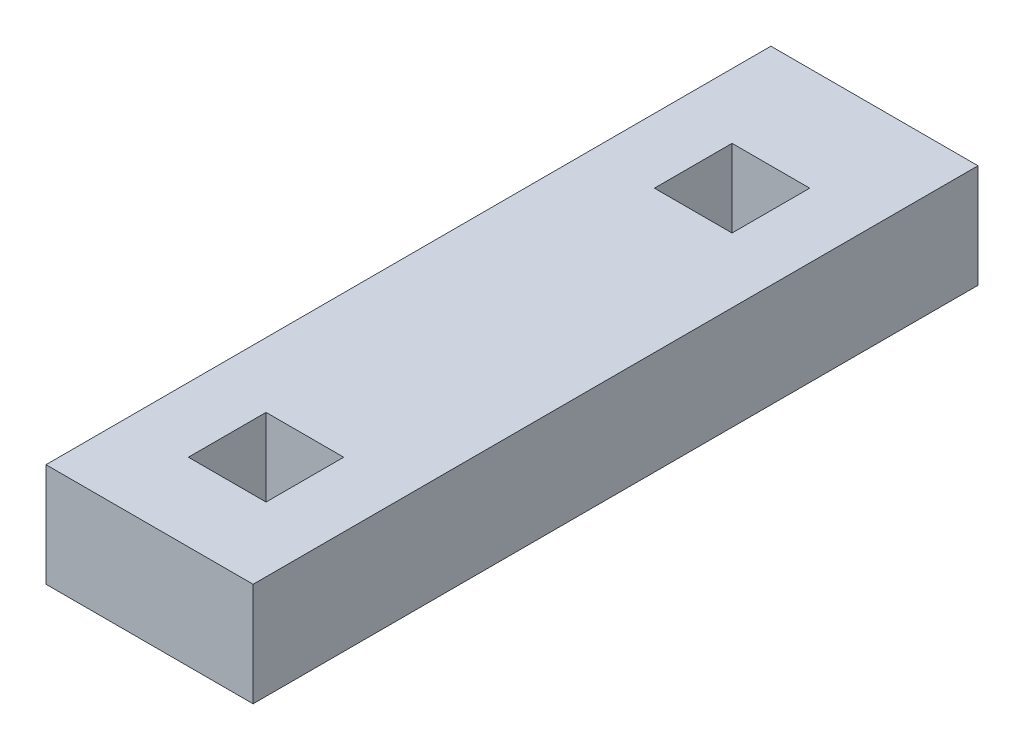
ISO-10303-21;
HEADER;
FILE_DESCRIPTION(('STEP AP214'),'2;1');
FILE_NAME('part.step','',(''),(''),'','','');
FILE_SCHEMA(('AUTOMOTIVE_DESIGN { 1 0 10303 214 1 1 1 1 }'));
ENDSEC;
DATA;
#1=APPLICATION_CONTEXT('core data for automotive mechanical design processes');
#2=APPLICATION_PROTOCOL_DEFINITION('international standard','automotive_design',2000,#1);
#3=PRODUCT_CONTEXT('',#1,'mechanical');
#4=PRODUCT('Part','Part','',(#3));
#5=PRODUCT_RELATED_PRODUCT_CATEGORY('part','',(#4));
#6=PRODUCT_DEFINITION_FORMATION('','',#4);
#7=PRODUCT_DEFINITION_CONTEXT('part definition',#1,'design');
#8=PRODUCT_DEFINITION('design','',#6,#7);
#9=PRODUCT_DEFINITION_SHAPE('','',#8);
#10=(LENGTH_UNIT() NAMED_UNIT(*) SI_UNIT(.MILLI.,.METRE.));
#11=(NAMED_UNIT(*) PLANE_ANGLE_UNIT() SI_UNIT($,.RADIAN.));
#12=(NAMED_UNIT(*) SI_UNIT($,.STERADIAN.) SOLID_ANGLE_UNIT());
#13=UNCERTAINTY_MEASURE_WITH_UNIT(LENGTH_MEASURE(1.E-05),#10,'distance_accuracy_value','');
#14=(GEOMETRIC_REPRESENTATION_CONTEXT(3) GLOBAL_UNCERTAINTY_ASSIGNED_CONTEXT((#13)) GLOBAL_UNIT_ASSIGNED_CONTEXT((#10,
#11,#12)) REPRESENTATION_CONTEXT('',''));
#15=CARTESIAN_POINT('',(0.,0.,0.));
#16=DIRECTION('',(0.,0.,1.));
#17=DIRECTION('',(1.,0.,0.));
#18=AXIS2_PLACEMENT_3D('',#15,#16,#17);
#19=CARTESIAN_POINT('',(0.,0.,711.2));
#20=DIRECTION('',(1.,0.,0.));
#21=DIRECTION('',(0.,0.,-1.));
#22=AXIS2_PLACEMENT_3D('',#19,#20,#21);
#23=PLANE('',#22);
#24=DIRECTION('',(0.,-1.,0.));
#25=VECTOR('',#24,1.);
#26=CARTESIAN_POINT('',(0.,0.,0.));
#27=LINE('',#26,#25);
#28=CARTESIAN_POINT('',(0.,101.6,0.));
#29=VERTEX_POINT('',#28);
#30=CARTESIAN_POINT('',(0.,0.,0.));
#31=VERTEX_POINT('',#30);
#32=EDGE_CURVE('E189',#29,#31,#27,.T.);
#33=ORIENTED_EDGE('',*,*,#32,.T.);
#34=DIRECTION('',(0.,0.,-1.));
#35=VECTOR('',#34,1.);
#36=CARTESIAN_POINT('',(0.,0.,711.2));
#37=LINE('',#36,#35);
#38=CARTESIAN_POINT('',(0.,0.,711.2));
#39=VERTEX_POINT('',#38);
#40=EDGE_CURVE('E11',#39,#31,#37,.T.);
#41=ORIENTED_EDGE('',*,*,#40,.F.);
#42=DIRECTION('',(0.,-1.,0.));
#43=VECTOR('',#42,1.);
#44=CARTESIAN_POINT('',(0.,0.,711.2));
#45=LINE('',#44,#43);
#46=CARTESIAN_POINT('',(0.,101.6,711.2));
#47=VERTEX_POINT('',#46);
#48=EDGE_CURVE('E195',#47,#39,#45,.T.);
#49=ORIENTED_EDGE('',*,*,#48,.F.);
#50=DIRECTION('',(0.,0.,-1.));
#51=VECTOR('',#50,1.);
#52=CARTESIAN_POINT('',(0.,101.6,711.2));
#53=LINE('',#52,#51);
#54=EDGE_CURVE('E205',#47,#29,#53,.T.);
#55=ORIENTED_EDGE('',*,*,#54,.T.);
#56=EDGE_LOOP('',(#33,#41,#49,#55));
#57=FACE_BOUND('',#56,.T.);
#58=ADVANCED_FACE('F38',(#57),#23,.F.);
#59=CARTESIAN_POINT('',(0.,0.,711.2));
#60=DIRECTION('',(0.,1.,0.));
#61=DIRECTION('',(0.,0.,1.));
#62=AXIS2_PLACEMENT_3D('',#59,#60,#61);
#63=PLANE('',#62);
#64=DIRECTION('',(1.,0.,0.));
#65=VECTOR('',#64,1.);
#66=CARTESIAN_POINT('',(0.,0.,0.));
#67=LINE('',#66,#65);
#68=CARTESIAN_POINT('',(203.2,0.,0.));
#69=VERTEX_POINT('',#68);
#70=EDGE_CURVE('E208',#31,#69,#67,.T.);
#71=ORIENTED_EDGE('',*,*,#70,.T.);
#72=DIRECTION('',(0.,0.,-1.));
#73=VECTOR('',#72,1.);
#74=CARTESIAN_POINT('',(203.2,0.,711.2));
#75=LINE('',#74,#73);
#76=CARTESIAN_POINT('',(203.2,0.,711.2));
#77=VERTEX_POINT('',#76);
#78=EDGE_CURVE('E45',#77,#69,#75,.T.);
#79=ORIENTED_EDGE('',*,*,#78,.F.);
#80=DIRECTION('',(1.,0.,0.));
#81=VECTOR('',#80,1.);
#82=CARTESIAN_POINT('',(0.,0.,711.2));
#83=LINE('',#82,#81);
#84=EDGE_CURVE('E198',#39,#77,#83,.T.);
#85=ORIENTED_EDGE('',*,*,#84,.F.);
#86=ORIENTED_EDGE('',*,*,#40,.T.);
#87=EDGE_LOOP('',(#71,#79,#85,#86));
#88=FACE_BOUND('',#87,.T.);
#89=ADVANCED_FACE('F238',(#88),#63,.F.);
#90=CARTESIAN_POINT('',(203.2,0.,711.2));
#91=DIRECTION('',(-1.,0.,0.));
#92=DIRECTION('',(0.,0.,1.));
#93=AXIS2_PLACEMENT_3D('',#90,#91,#92);
#94=PLANE('',#93);
#95=DIRECTION('',(0.,1.,0.));
#96=VECTOR('',#95,1.);
#97=CARTESIAN_POINT('',(203.2,0.,0.));
#98=LINE('',#97,#96);
#99=CARTESIAN_POINT('',(203.2,101.6,0.));
#100=VERTEX_POINT('',#99);
#101=EDGE_CURVE('E210',#69,#100,#98,.T.);
#102=ORIENTED_EDGE('',*,*,#101,.T.);
#103=DIRECTION('',(0.,0.,-1.));
#104=VECTOR('',#103,1.);
#105=CARTESIAN_POINT('',(203.2,101.6,711.2));
#106=LINE('',#105,#104);
#107=CARTESIAN_POINT('',(203.2,101.6,711.2));
#108=VERTEX_POINT('',#107);
#109=EDGE_CURVE('E215',#108,#100,#106,.T.);
#110=ORIENTED_EDGE('',*,*,#109,.F.);
#111=DIRECTION('',(0.,1.,0.));
#112=VECTOR('',#111,1.);
#113=CARTESIAN_POINT('',(203.2,0.,711.2));
#114=LINE('',#113,#112);
#115=EDGE_CURVE('E201',#77,#108,#114,.T.);
#116=ORIENTED_EDGE('',*,*,#115,.F.);
#117=ORIENTED_EDGE('',*,*,#78,.T.);
#118=EDGE_LOOP('',(#102,#110,#116,#117));
#119=FACE_BOUND('',#118,.T.);
#120=ADVANCED_FACE('F222',(#119),#94,.F.);
#121=CARTESIAN_POINT('',(0.,101.6,711.2));
#122=DIRECTION('',(0.,-1.,0.));
#123=DIRECTION('',(0.,0.,-1.));
#124=AXIS2_PLACEMENT_3D('',#121,#122,#123);
#125=PLANE('',#124);
#126=DIRECTION('',(-1.,0.,0.));
#127=VECTOR('',#126,1.);
#128=CARTESIAN_POINT('',(63.5,101.6,558.8));
#129=LINE('',#128,#127);
#130=CARTESIAN_POINT('',(139.7,101.6,558.8));
#131=VERTEX_POINT('',#130);
#132=CARTESIAN_POINT('',(63.5,101.6,558.8));
#133=VERTEX_POINT('',#132);
#134=EDGE_CURVE('E155',#131,#133,#129,.T.);
#135=ORIENTED_EDGE('',*,*,#134,.F.);
#136=DIRECTION('',(0.,0.,-1.));
#137=VECTOR('',#136,1.);
#138=CARTESIAN_POINT('',(139.7,101.6,635.));
#139=LINE('',#138,#137);
#140=CARTESIAN_POINT('',(139.7,101.6,635.));
#141=VERTEX_POINT('',#140);
#142=EDGE_CURVE('E52',#141,#131,#139,.T.);
#143=ORIENTED_EDGE('',*,*,#142,.F.);
#144=DIRECTION('',(1.,0.,0.));
#145=VECTOR('',#144,1.);
#146=CARTESIAN_POINT('',(63.5,101.6,635.));
#147=LINE('',#146,#145);
#148=CARTESIAN_POINT('',(63.5,101.6,635.));
#149=VERTEX_POINT('',#148);
#150=EDGE_CURVE('E146',#149,#141,#147,.T.);
#151=ORIENTED_EDGE('',*,*,#150,.F.);
#152=DIRECTION('',(0.,0.,1.));
#153=VECTOR('',#152,1.);
#154=CARTESIAN_POINT('',(63.5,101.6,635.));
#155=LINE('',#154,#153);
#156=EDGE_CURVE('E149',#133,#149,#155,.T.);
#157=ORIENTED_EDGE('',*,*,#156,.F.);
#158=EDGE_LOOP('',(#135,#143,#151,#157));
#159=FACE_BOUND('',#158,.T.);
#160=DIRECTION('',(-1.,0.,0.));
#161=VECTOR('',#160,1.);
#162=CARTESIAN_POINT('',(63.5,101.6,101.6));
#163=LINE('',#162,#161);
#164=CARTESIAN_POINT('',(139.7,101.6,101.6));
#165=VERTEX_POINT('',#164);
#166=CARTESIAN_POINT('',(63.5,101.6,101.6));
#167=VERTEX_POINT('',#166);
#168=EDGE_CURVE('E179',#165,#167,#163,.T.);
#169=ORIENTED_EDGE('',*,*,#168,.F.);
#170=DIRECTION('',(0.,0.,-1.));
#171=VECTOR('',#170,1.);
#172=CARTESIAN_POINT('',(139.7,101.6,177.8));
#173=LINE('',#172,#171);
#174=CARTESIAN_POINT('',(139.7,101.6,177.8));
#175=VERTEX_POINT('',#174);
#176=EDGE_CURVE('E60',#175,#165,#173,.T.);
#177=ORIENTED_EDGE('',*,*,#176,.F.);
#178=DIRECTION('',(1.,0.,0.));
#179=VECTOR('',#178,1.);
#180=CARTESIAN_POINT('',(63.5,101.6,177.8));
#181=LINE('',#180,#179);
#182=CARTESIAN_POINT('',(63.5,101.6,177.8));
#183=VERTEX_POINT('',#182);
#184=EDGE_CURVE('E168',#183,#175,#181,.T.);
#185=ORIENTED_EDGE('',*,*,#184,.F.);
#186=DIRECTION('',(0.,0.,1.));
#187=VECTOR('',#186,1.);
#188=CARTESIAN_POINT('',(63.5,101.6,177.8));
#189=LINE('',#188,#187);
#190=EDGE_CURVE('E182',#167,#183,#189,.T.);
#191=ORIENTED_EDGE('',*,*,#190,.F.);
#192=EDGE_LOOP('',(#169,#177,#185,#191));
#193=FACE_BOUND('',#192,.T.);
#194=DIRECTION('',(-1.,0.,0.));
#195=VECTOR('',#194,1.);
#196=CARTESIAN_POINT('',(0.,101.6,0.));
#197=LINE('',#196,#195);
#198=EDGE_CURVE('E199',#100,#29,#197,.T.);
#199=ORIENTED_EDGE('',*,*,#198,.T.);
#200=ORIENTED_EDGE('',*,*,#54,.F.);
#201=DIRECTION('',(-1.,0.,0.));
#202=VECTOR('',#201,1.);
#203=CARTESIAN_POINT('',(0.,101.6,711.2));
#204=LINE('',#203,#202);
#205=EDGE_CURVE('E203',#108,#47,#204,.T.);
#206=ORIENTED_EDGE('',*,*,#205,.F.);
#207=ORIENTED_EDGE('',*,*,#109,.T.);
#208=EDGE_LOOP('',(#199,#200,#206,#207));
#209=FACE_BOUND('',#208,.T.);
#210=ADVANCED_FACE('F231',(#159,#193,#209),#125,.F.);
#211=CARTESIAN_POINT('',(0.,0.,711.2));
#212=DIRECTION('',(0.,0.,-1.));
#213=DIRECTION('',(-1.,0.,0.));
#214=AXIS2_PLACEMENT_3D('',#211,#212,#213);
#215=PLANE('',#214);
#216=ORIENTED_EDGE('',*,*,#48,.T.);
#217=ORIENTED_EDGE('',*,*,#84,.T.);
#218=ORIENTED_EDGE('',*,*,#115,.T.);
#219=ORIENTED_EDGE('',*,*,#205,.T.);
#220=EDGE_LOOP('',(#216,#217,#218,#219));
#221=FACE_BOUND('',#220,.T.);
#222=ADVANCED_FACE('F237',(#221),#215,.F.);
#223=CARTESIAN_POINT('',(0.,0.,0.));
#224=DIRECTION('',(0.,0.,-1.));
#225=DIRECTION('',(-1.,0.,0.));
#226=AXIS2_PLACEMENT_3D('',#223,#224,#225);
#227=PLANE('',#226);
#228=ORIENTED_EDGE('',*,*,#32,.F.);
#229=ORIENTED_EDGE('',*,*,#198,.F.);
#230=ORIENTED_EDGE('',*,*,#101,.F.);
#231=ORIENTED_EDGE('',*,*,#70,.F.);
#232=EDGE_LOOP('',(#228,#229,#230,#231));
#233=FACE_BOUND('',#232,.T.);
#234=ADVANCED_FACE('F228',(#233),#227,.T.);
#235=CARTESIAN_POINT('',(139.7,25.4,177.8));
#236=DIRECTION('',(1.,0.,0.));
#237=DIRECTION('',(0.,0.,-1.));
#238=AXIS2_PLACEMENT_3D('',#235,#236,#237);
#239=PLANE('',#238);
#240=ORIENTED_EDGE('',*,*,#176,.T.);
#241=DIRECTION('',(0.,1.,0.));
#242=VECTOR('',#241,1.);
#243=CARTESIAN_POINT('',(139.7,25.4,101.6));
#244=LINE('',#243,#242);
#245=CARTESIAN_POINT('',(139.7,25.4,101.6));
#246=VERTEX_POINT('',#245);
#247=EDGE_CURVE('E177',#246,#165,#244,.T.);
#248=ORIENTED_EDGE('',*,*,#247,.F.);
#249=DIRECTION('',(0.,0.,-1.));
#250=VECTOR('',#249,1.);
#251=CARTESIAN_POINT('',(139.7,25.4,177.8));
#252=LINE('',#251,#250);
#253=CARTESIAN_POINT('',(139.7,25.4,177.8));
#254=VERTEX_POINT('',#253);
#255=EDGE_CURVE('E164',#254,#246,#252,.T.);
#256=ORIENTED_EDGE('',*,*,#255,.F.);
#257=DIRECTION('',(0.,1.,0.));
#258=VECTOR('',#257,1.);
#259=CARTESIAN_POINT('',(139.7,25.4,177.8));
#260=LINE('',#259,#258);
#261=EDGE_CURVE('E187',#254,#175,#260,.T.);
#262=ORIENTED_EDGE('',*,*,#261,.T.);
#263=EDGE_LOOP('',(#240,#248,#256,#262));
#264=FACE_BOUND('',#263,.T.);
#265=ADVANCED_FACE('F251',(#264),#239,.F.);
#266=CARTESIAN_POINT('',(63.5,25.4,177.8));
#267=DIRECTION('',(0.,0.,1.));
#268=DIRECTION('',(1.,0.,0.));
#269=AXIS2_PLACEMENT_3D('',#266,#267,#268);
#270=PLANE('',#269);
#271=ORIENTED_EDGE('',*,*,#184,.T.);
#272=ORIENTED_EDGE('',*,*,#261,.F.);
#273=DIRECTION('',(1.,0.,0.));
#274=VECTOR('',#273,1.);
#275=CARTESIAN_POINT('',(63.5,25.4,177.8));
#276=LINE('',#275,#274);
#277=CARTESIAN_POINT('',(63.5,25.4,177.8));
#278=VERTEX_POINT('',#277);
#279=EDGE_CURVE('E174',#278,#254,#276,.T.);
#280=ORIENTED_EDGE('',*,*,#279,.F.);
#281=DIRECTION('',(0.,1.,0.));
#282=VECTOR('',#281,1.);
#283=CARTESIAN_POINT('',(63.5,25.4,177.8));
#284=LINE('',#283,#282);
#285=EDGE_CURVE('E190',#278,#183,#284,.T.);
#286=ORIENTED_EDGE('',*,*,#285,.T.);
#287=EDGE_LOOP('',(#271,#272,#280,#286));
#288=FACE_BOUND('',#287,.T.);
#289=ADVANCED_FACE('F256',(#288),#270,.F.);
#290=CARTESIAN_POINT('',(63.5,25.4,177.8));
#291=DIRECTION('',(-1.,0.,0.));
#292=DIRECTION('',(0.,0.,1.));
#293=AXIS2_PLACEMENT_3D('',#290,#291,#292);
#294=PLANE('',#293);
#295=ORIENTED_EDGE('',*,*,#190,.T.);
#296=ORIENTED_EDGE('',*,*,#285,.F.);
#297=DIRECTION('',(0.,0.,1.));
#298=VECTOR('',#297,1.);
#299=CARTESIAN_POINT('',(63.5,25.4,177.8));
#300=LINE('',#299,#298);
#301=CARTESIAN_POINT('',(63.5,25.4,101.6));
#302=VERTEX_POINT('',#301);
#303=EDGE_CURVE('E171',#302,#278,#300,.T.);
#304=ORIENTED_EDGE('',*,*,#303,.F.);
#305=DIRECTION('',(0.,1.,0.));
#306=VECTOR('',#305,1.);
#307=CARTESIAN_POINT('',(63.5,25.4,101.6));
#308=LINE('',#307,#306);
#309=EDGE_CURVE('E192',#302,#167,#308,.T.);
#310=ORIENTED_EDGE('',*,*,#309,.T.);
#311=EDGE_LOOP('',(#295,#296,#304,#310));
#312=FACE_BOUND('',#311,.T.);
#313=ADVANCED_FACE('F261',(#312),#294,.F.);
#314=CARTESIAN_POINT('',(63.5,25.4,101.6));
#315=DIRECTION('',(0.,0.,-1.));
#316=DIRECTION('',(-1.,0.,0.));
#317=AXIS2_PLACEMENT_3D('',#314,#315,#316);
#318=PLANE('',#317);
#319=ORIENTED_EDGE('',*,*,#168,.T.);
#320=ORIENTED_EDGE('',*,*,#309,.F.);
#321=DIRECTION('',(-1.,0.,0.));
#322=VECTOR('',#321,1.);
#323=CARTESIAN_POINT('',(63.5,25.4,101.6));
#324=LINE('',#323,#322);
#325=EDGE_CURVE('E167',#246,#302,#324,.T.);
#326=ORIENTED_EDGE('',*,*,#325,.F.);
#327=ORIENTED_EDGE('',*,*,#247,.T.);
#328=EDGE_LOOP('',(#319,#320,#326,#327));
#329=FACE_BOUND('',#328,.T.);
#330=ADVANCED_FACE('F257',(#329),#318,.F.);
#331=CARTESIAN_POINT('',(0.,25.4,0.));
#332=DIRECTION('',(0.,-1.,0.));
#333=DIRECTION('',(0.,0.,-1.));
#334=AXIS2_PLACEMENT_3D('',#331,#332,#333);
#335=PLANE('',#334);
#336=ORIENTED_EDGE('',*,*,#255,.T.);
#337=ORIENTED_EDGE('',*,*,#325,.T.);
#338=ORIENTED_EDGE('',*,*,#303,.T.);
#339=ORIENTED_EDGE('',*,*,#279,.T.);
#340=EDGE_LOOP('',(#336,#337,#338,#339));
#341=FACE_BOUND('',#340,.T.);
#342=ADVANCED_FACE('F260',(#341),#335,.F.);
#343=CARTESIAN_POINT('',(139.7,25.4,635.));
#344=DIRECTION('',(1.,0.,0.));
#345=DIRECTION('',(0.,0.,-1.));
#346=AXIS2_PLACEMENT_3D('',#343,#344,#345);
#347=PLANE('',#346);
#348=ORIENTED_EDGE('',*,*,#142,.T.);
#349=DIRECTION('',(0.,1.,0.));
#350=VECTOR('',#349,1.);
#351=CARTESIAN_POINT('',(139.7,25.4,558.8));
#352=LINE('',#351,#350);
#353=CARTESIAN_POINT('',(139.7,25.4,558.8));
#354=VERTEX_POINT('',#353);
#355=EDGE_CURVE('E124',#354,#131,#352,.T.);
#356=ORIENTED_EDGE('',*,*,#355,.F.);
#357=DIRECTION('',(0.,0.,-1.));
#358=VECTOR('',#357,1.);
#359=CARTESIAN_POINT('',(139.7,25.4,635.));
#360=LINE('',#359,#358);
#361=CARTESIAN_POINT('',(139.7,25.4,635.));
#362=VERTEX_POINT('',#361);
#363=EDGE_CURVE('E128',#362,#354,#360,.T.);
#364=ORIENTED_EDGE('',*,*,#363,.F.);
#365=DIRECTION('',(0.,1.,0.));
#366=VECTOR('',#365,1.);
#367=CARTESIAN_POINT('',(139.7,25.4,635.));
#368=LINE('',#367,#366);
#369=EDGE_CURVE('E159',#362,#141,#368,.T.);
#370=ORIENTED_EDGE('',*,*,#369,.T.);
#371=EDGE_LOOP('',(#348,#356,#364,#370));
#372=FACE_BOUND('',#371,.T.);
#373=ADVANCED_FACE('F126',(#372),#347,.F.);
#374=CARTESIAN_POINT('',(63.5,25.4,635.));
#375=DIRECTION('',(0.,0.,1.));
#376=DIRECTION('',(1.,0.,0.));
#377=AXIS2_PLACEMENT_3D('',#374,#375,#376);
#378=PLANE('',#377);
#379=ORIENTED_EDGE('',*,*,#150,.T.);
#380=ORIENTED_EDGE('',*,*,#369,.F.);
#381=DIRECTION('',(1.,0.,0.));
#382=VECTOR('',#381,1.);
#383=CARTESIAN_POINT('',(63.5,25.4,635.));
#384=LINE('',#383,#382);
#385=CARTESIAN_POINT('',(63.5,25.4,635.));
#386=VERTEX_POINT('',#385);
#387=EDGE_CURVE('E134',#386,#362,#384,.T.);
#388=ORIENTED_EDGE('',*,*,#387,.F.);
#389=DIRECTION('',(0.,1.,0.));
#390=VECTOR('',#389,1.);
#391=CARTESIAN_POINT('',(63.5,25.4,635.));
#392=LINE('',#391,#390);
#393=EDGE_CURVE('E161',#386,#149,#392,.T.);
#394=ORIENTED_EDGE('',*,*,#393,.T.);
#395=EDGE_LOOP('',(#379,#380,#388,#394));
#396=FACE_BOUND('',#395,.T.);
#397=ADVANCED_FACE('F274',(#396),#378,.F.);
#398=CARTESIAN_POINT('',(63.5,25.4,635.));
#399=DIRECTION('',(-1.,0.,0.));
#400=DIRECTION('',(0.,0.,1.));
#401=AXIS2_PLACEMENT_3D('',#398,#399,#400);
#402=PLANE('',#401);
#403=ORIENTED_EDGE('',*,*,#156,.T.);
#404=ORIENTED_EDGE('',*,*,#393,.F.);
#405=DIRECTION('',(0.,0.,1.));
#406=VECTOR('',#405,1.);
#407=CARTESIAN_POINT('',(63.5,25.4,635.));
#408=LINE('',#407,#406);
#409=CARTESIAN_POINT('',(63.5,25.4,558.8));
#410=VERTEX_POINT('',#409);
#411=EDGE_CURVE('E142',#410,#386,#408,.T.);
#412=ORIENTED_EDGE('',*,*,#411,.F.);
#413=DIRECTION('',(0.,1.,0.));
#414=VECTOR('',#413,1.);
#415=CARTESIAN_POINT('',(63.5,25.4,558.8));
#416=LINE('',#415,#414);
#417=EDGE_CURVE('E133',#410,#133,#416,.T.);
#418=ORIENTED_EDGE('',*,*,#417,.T.);
#419=EDGE_LOOP('',(#403,#404,#412,#418));
#420=FACE_BOUND('',#419,.T.);
#421=ADVANCED_FACE('F277',(#420),#402,.F.);
#422=CARTESIAN_POINT('',(63.5,25.4,558.8));
#423=DIRECTION('',(0.,0.,-1.));
#424=DIRECTION('',(-1.,0.,0.));
#425=AXIS2_PLACEMENT_3D('',#422,#423,#424);
#426=PLANE('',#425);
#427=ORIENTED_EDGE('',*,*,#134,.T.);
#428=ORIENTED_EDGE('',*,*,#417,.F.);
#429=DIRECTION('',(-1.,0.,0.));
#430=VECTOR('',#429,1.);
#431=CARTESIAN_POINT('',(63.5,25.4,558.8));
#432=LINE('',#431,#430);
#433=EDGE_CURVE('E137',#354,#410,#432,.T.);
#434=ORIENTED_EDGE('',*,*,#433,.F.);
#435=ORIENTED_EDGE('',*,*,#355,.T.);
#436=EDGE_LOOP('',(#427,#428,#434,#435));
#437=FACE_BOUND('',#436,.T.);
#438=ADVANCED_FACE('F138',(#437),#426,.F.);
#439=CARTESIAN_POINT('',(0.,25.4,0.));
#440=DIRECTION('',(0.,-1.,0.));
#441=DIRECTION('',(0.,0.,-1.));
#442=AXIS2_PLACEMENT_3D('',#439,#440,#441);
#443=PLANE('',#442);
#444=ORIENTED_EDGE('',*,*,#363,.T.);
#445=ORIENTED_EDGE('',*,*,#433,.T.);
#446=ORIENTED_EDGE('',*,*,#411,.T.);
#447=ORIENTED_EDGE('',*,*,#387,.T.);
#448=EDGE_LOOP('',(#444,#445,#446,#447));
#449=FACE_BOUND('',#448,.T.);
#450=ADVANCED_FACE('F144',(#449),#443,.F.);
#451=CLOSED_SHELL('',(#58,#89,#120,#210,#222,#234,#265,#289,#313,#330,#342,#373,#397,#421,#438,#450));
#452=MANIFOLD_SOLID_BREP('B2',#451);
#453=ADVANCED_BREP_SHAPE_REPRESENTATION('',(#18,#452),#14);
#454=SHAPE_DEFINITION_REPRESENTATION(#9,#453);
ENDSEC;
END-ISO-10303-21;
